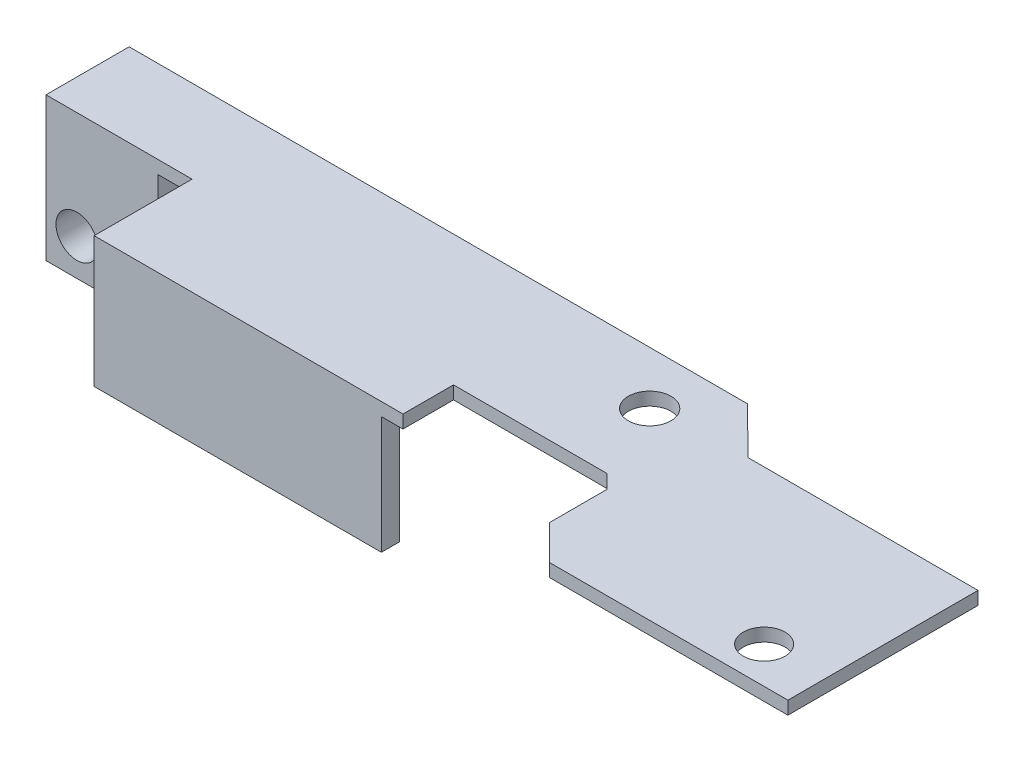
ISO-10303-21;
HEADER;
FILE_DESCRIPTION(('STEP AP214'),'2;1');
FILE_NAME('part.step','',(''),(''),'','','');
FILE_SCHEMA(('AUTOMOTIVE_DESIGN { 1 0 10303 214 1 1 1 1 }'));
ENDSEC;
DATA;
#1=APPLICATION_CONTEXT('core data for automotive mechanical design processes');
#2=APPLICATION_PROTOCOL_DEFINITION('international standard','automotive_design',2000,#1);
#3=PRODUCT_CONTEXT('',#1,'mechanical');
#4=PRODUCT('Part','Part','',(#3));
#5=PRODUCT_RELATED_PRODUCT_CATEGORY('part','',(#4));
#6=PRODUCT_DEFINITION_FORMATION('','',#4);
#7=PRODUCT_DEFINITION_CONTEXT('part definition',#1,'design');
#8=PRODUCT_DEFINITION('design','',#6,#7);
#9=PRODUCT_DEFINITION_SHAPE('','',#8);
#10=(LENGTH_UNIT() NAMED_UNIT(*) SI_UNIT(.MILLI.,.METRE.));
#11=(NAMED_UNIT(*) PLANE_ANGLE_UNIT() SI_UNIT($,.RADIAN.));
#12=(NAMED_UNIT(*) SI_UNIT($,.STERADIAN.) SOLID_ANGLE_UNIT());
#13=UNCERTAINTY_MEASURE_WITH_UNIT(LENGTH_MEASURE(1.E-05),#10,'distance_accuracy_value','');
#14=(GEOMETRIC_REPRESENTATION_CONTEXT(3) GLOBAL_UNCERTAINTY_ASSIGNED_CONTEXT((#13)) GLOBAL_UNIT_ASSIGNED_CONTEXT((#10,
#11,#12)) REPRESENTATION_CONTEXT('',''));
#15=CARTESIAN_POINT('',(0.,0.,0.));
#16=DIRECTION('',(0.,0.,1.));
#17=DIRECTION('',(1.,0.,0.));
#18=AXIS2_PLACEMENT_3D('',#15,#16,#17);
#19=CARTESIAN_POINT('',(0.,0.,0.));
#20=DIRECTION('',(0.,-1.,0.));
#21=DIRECTION('',(0.,0.,-1.));
#22=AXIS2_PLACEMENT_3D('',#19,#20,#21);
#23=PLANE('',#22);
#24=DIRECTION('',(-1.,0.,0.));
#25=VECTOR('',#24,1.);
#26=CARTESIAN_POINT('',(-57.9590886407395,0.,1.36638278632961));
#27=LINE('',#26,#25);
#28=CARTESIAN_POINT('',(-46.7720066556487,0.,1.36638278632961));
#29=VERTEX_POINT('',#28);
#30=CARTESIAN_POINT('',(-49.3972410342507,0.,1.36638278632961));
#31=VERTEX_POINT('',#30);
#32=EDGE_CURVE('E192',#29,#31,#27,.T.);
#33=ORIENTED_EDGE('',*,*,#32,.T.);
#34=DIRECTION('',(0.,0.,1.));
#35=VECTOR('',#34,1.);
#36=CARTESIAN_POINT('',(-49.3972410342507,0.,2.36638278632961));
#37=LINE('',#36,#35);
#38=CARTESIAN_POINT('',(-49.3972410342507,0.,-5.));
#39=VERTEX_POINT('',#38);
#40=EDGE_CURVE('E191',#39,#31,#37,.T.);
#41=ORIENTED_EDGE('',*,*,#40,.F.);
#42=DIRECTION('',(-1.,0.,0.));
#43=VECTOR('',#42,1.);
#44=CARTESIAN_POINT('',(-59.2590886407395,0.,-5.));
#45=LINE('',#44,#43);
#46=CARTESIAN_POINT('',(-10.5928853754941,0.,-5.));
#47=VERTEX_POINT('',#46);
#48=EDGE_CURVE('E274',#47,#39,#45,.T.);
#49=ORIENTED_EDGE('',*,*,#48,.F.);
#50=DIRECTION('',(-0.708293229836923,0.,-0.705918338455079));
#51=VECTOR('',#50,1.);
#52=CARTESIAN_POINT('',(-10.5928853754941,0.,-5.));
#53=LINE('',#52,#51);
#54=CARTESIAN_POINT('',(-7.03322684079496,0.,-1.45227692087246));
#55=VERTEX_POINT('',#54);
#56=EDGE_CURVE('E239',#55,#47,#53,.T.);
#57=ORIENTED_EDGE('',*,*,#56,.F.);
#58=DIRECTION('',(-1.,0.,0.));
#59=VECTOR('',#58,1.);
#60=CARTESIAN_POINT('',(-7.03322684079496,0.,-1.45227692087246));
#61=LINE('',#60,#59);
#62=CARTESIAN_POINT('',(10.5928853754941,0.,-1.45227692087246));
#63=VERTEX_POINT('',#62);
#64=EDGE_CURVE('E246',#63,#55,#61,.T.);
#65=ORIENTED_EDGE('',*,*,#64,.F.);
#66=DIRECTION('',(0.,0.,-1.));
#67=VECTOR('',#66,1.);
#68=CARTESIAN_POINT('',(10.5928853754941,0.,5.));
#69=LINE('',#68,#67);
#70=CARTESIAN_POINT('',(10.5928853754941,0.,13.1052865972663));
#71=VERTEX_POINT('',#70);
#72=EDGE_CURVE('E296',#71,#63,#69,.T.);
#73=ORIENTED_EDGE('',*,*,#72,.F.);
#74=DIRECTION('',(1.,0.,0.));
#75=VECTOR('',#74,1.);
#76=CARTESIAN_POINT('',(10.5928853754941,0.,13.1052865972663));
#77=LINE('',#76,#75);
#78=CARTESIAN_POINT('',(-7.64895836213277,0.,13.1052865972663));
#79=VERTEX_POINT('',#78);
#80=EDGE_CURVE('E293',#79,#71,#77,.T.);
#81=ORIENTED_EDGE('',*,*,#80,.F.);
#82=DIRECTION('',(0.707106781186548,0.,0.707106781186547));
#83=VECTOR('',#82,1.);
#84=CARTESIAN_POINT('',(-7.64895836213277,0.,13.1052865972663));
#85=LINE('',#84,#83);
#86=CARTESIAN_POINT('',(-10.3117462140529,0.,10.4424987453461));
#87=VERTEX_POINT('',#86);
#88=EDGE_CURVE('E291',#87,#79,#85,.T.);
#89=ORIENTED_EDGE('',*,*,#88,.F.);
#90=DIRECTION('',(0.,0.,1.));
#91=VECTOR('',#90,1.);
#92=CARTESIAN_POINT('',(-10.3117462140529,0.,10.4424987453461));
#93=LINE('',#92,#91);
#94=CARTESIAN_POINT('',(-10.3117462140529,0.,6.04969033065439));
#95=VERTEX_POINT('',#94);
#96=EDGE_CURVE('E289',#95,#87,#93,.T.);
#97=ORIENTED_EDGE('',*,*,#96,.F.);
#98=DIRECTION('',(0.707106781186548,0.,0.707106781186548));
#99=VECTOR('',#98,1.);
#100=CARTESIAN_POINT('',(-10.3117462140529,0.,6.04969033065439));
#101=LINE('',#100,#99);
#102=CARTESIAN_POINT('',(-11.3640576509498,0.,4.99737889375753));
#103=VERTEX_POINT('',#102);
#104=EDGE_CURVE('E287',#103,#95,#101,.T.);
#105=ORIENTED_EDGE('',*,*,#104,.F.);
#106=DIRECTION('',(0.012396503632101,0.,-0.999923160396687));
#107=VECTOR('',#106,1.);
#108=CARTESIAN_POINT('',(-11.3640576509498,0.,4.99737889375753));
#109=LINE('',#108,#107);
#110=CARTESIAN_POINT('',(-11.3640901459998,0.,5.));
#111=VERTEX_POINT('',#110);
#112=EDGE_CURVE('E285',#111,#103,#109,.T.);
#113=ORIENTED_EDGE('',*,*,#112,.F.);
#114=DIRECTION('',(1.,0.,0.));
#115=VECTOR('',#114,1.);
#116=CARTESIAN_POINT('',(-23.1200043074193,0.,5.));
#117=LINE('',#116,#115);
#118=CARTESIAN_POINT('',(-23.1200043074193,0.,5.));
#119=VERTEX_POINT('',#118);
#120=EDGE_CURVE('E283',#119,#111,#117,.T.);
#121=ORIENTED_EDGE('',*,*,#120,.F.);
#122=DIRECTION('',(0.,0.,-1.));
#123=VECTOR('',#122,1.);
#124=CARTESIAN_POINT('',(-23.1200043074193,0.,8.86638278632961));
#125=LINE('',#124,#123);
#126=CARTESIAN_POINT('',(-23.1200043074193,0.,8.86638278632961));
#127=VERTEX_POINT('',#126);
#128=EDGE_CURVE('E281',#127,#119,#125,.T.);
#129=ORIENTED_EDGE('',*,*,#128,.F.);
#130=DIRECTION('',(1.,0.,0.));
#131=VECTOR('',#130,1.);
#132=CARTESIAN_POINT('',(-46.7720066556487,0.,8.86638278632961));
#133=LINE('',#132,#131);
#134=CARTESIAN_POINT('',(-24.7755677780219,0.,8.86638278632961));
#135=VERTEX_POINT('',#134);
#136=EDGE_CURVE('E279',#135,#127,#133,.T.);
#137=ORIENTED_EDGE('',*,*,#136,.F.);
#138=DIRECTION('',(0.,0.,1.));
#139=VECTOR('',#138,1.);
#140=CARTESIAN_POINT('',(-24.7755677780219,0.,8.86638278632961));
#141=LINE('',#140,#139);
#142=CARTESIAN_POINT('',(-24.7755677780219,0.,7.46638278632961));
#143=VERTEX_POINT('',#142);
#144=EDGE_CURVE('E210',#143,#135,#141,.T.);
#145=ORIENTED_EDGE('',*,*,#144,.F.);
#146=DIRECTION('',(1.,0.,0.));
#147=VECTOR('',#146,1.);
#148=CARTESIAN_POINT('',(-46.7720066556487,0.,7.46638278632961));
#149=LINE('',#148,#147);
#150=CARTESIAN_POINT('',(-46.7720066556487,0.,7.46638278632961));
#151=VERTEX_POINT('',#150);
#152=EDGE_CURVE('E58',#151,#143,#149,.T.);
#153=ORIENTED_EDGE('',*,*,#152,.F.);
#154=DIRECTION('',(0.,0.,1.));
#155=VECTOR('',#154,1.);
#156=CARTESIAN_POINT('',(-46.7720066556487,0.,2.36638278632961));
#157=LINE('',#156,#155);
#158=EDGE_CURVE('E277',#29,#151,#157,.T.);
#159=ORIENTED_EDGE('',*,*,#158,.F.);
#160=EDGE_LOOP('',(#33,#41,#49,#57,#65,#73,#81,#89,#97,#105,#113,#121,#129,#137,#145,#153,#159));
#161=FACE_BOUND('',#160,.T.);
#162=CARTESIAN_POINT('',(-14.0394003656733,0.,-0.942703980219986));
#163=DIRECTION('',(0.,1.,0.));
#164=DIRECTION('',(0.,0.,1.));
#165=AXIS2_PLACEMENT_3D('',#162,#163,#164);
#166=CIRCLE('',#165,1.63256657868634);
#167=CARTESIAN_POINT('',(-14.0394003656733,0.,0.689862598466358));
#168=VERTEX_POINT('',#167);
#169=EDGE_CURVE('E233',#168,#168,#166,.T.);
#170=ORIENTED_EDGE('',*,*,#169,.T.);
#171=EDGE_LOOP('',(#170));
#172=FACE_BOUND('',#171,.T.);
#173=CARTESIAN_POINT('',(5.9687902256396,0.,10.3003450756937));
#174=DIRECTION('',(0.,1.,0.));
#175=DIRECTION('',(0.,0.,1.));
#176=AXIS2_PLACEMENT_3D('',#173,#174,#175);
#177=CIRCLE('',#176,1.6);
#178=CARTESIAN_POINT('',(5.9687902256396,0.,11.9003450756937));
#179=VERTEX_POINT('',#178);
#180=EDGE_CURVE('E229',#179,#179,#177,.T.);
#181=ORIENTED_EDGE('',*,*,#180,.T.);
#182=EDGE_LOOP('',(#181));
#183=FACE_BOUND('',#182,.T.);
#184=ADVANCED_FACE('F35',(#161,#172,#183),#23,.T.);
#185=CARTESIAN_POINT('',(0.,1.,0.));
#186=DIRECTION('',(0.,-1.,0.));
#187=DIRECTION('',(0.,0.,-1.));
#188=AXIS2_PLACEMENT_3D('',#185,#186,#187);
#189=PLANE('',#188);
#190=DIRECTION('',(-1.,0.,0.));
#191=VECTOR('',#190,1.);
#192=CARTESIAN_POINT('',(-59.2590886407395,1.,-5.));
#193=LINE('',#192,#191);
#194=CARTESIAN_POINT('',(-10.5928853754941,1.,-5.));
#195=VERTEX_POINT('',#194);
#196=CARTESIAN_POINT('',(-57.9590886407395,1.,-5.));
#197=VERTEX_POINT('',#196);
#198=EDGE_CURVE('E245',#195,#197,#193,.T.);
#199=ORIENTED_EDGE('',*,*,#198,.T.);
#200=DIRECTION('',(0.,0.,-1.));
#201=VECTOR('',#200,1.);
#202=CARTESIAN_POINT('',(-57.9590886407395,1.,-5.));
#203=LINE('',#202,#201);
#204=CARTESIAN_POINT('',(-57.9590886407395,1.,1.36638278632961));
#205=VERTEX_POINT('',#204);
#206=EDGE_CURVE('E373',#205,#197,#203,.T.);
#207=ORIENTED_EDGE('',*,*,#206,.F.);
#208=DIRECTION('',(-1.,0.,0.));
#209=VECTOR('',#208,1.);
#210=CARTESIAN_POINT('',(-57.9590886407395,1.,1.36638278632961));
#211=LINE('',#210,#209);
#212=CARTESIAN_POINT('',(-46.7720066556487,1.,1.36638278632961));
#213=VERTEX_POINT('',#212);
#214=EDGE_CURVE('E371',#213,#205,#211,.T.);
#215=ORIENTED_EDGE('',*,*,#214,.F.);
#216=DIRECTION('',(0.,0.,1.));
#217=VECTOR('',#216,1.);
#218=CARTESIAN_POINT('',(-46.7720066556487,1.,2.36638278632961));
#219=LINE('',#218,#217);
#220=CARTESIAN_POINT('',(-46.7720066556487,1.,8.86638278632961));
#221=VERTEX_POINT('',#220);
#222=EDGE_CURVE('E249',#213,#221,#219,.T.);
#223=ORIENTED_EDGE('',*,*,#222,.T.);
#224=DIRECTION('',(1.,0.,0.));
#225=VECTOR('',#224,1.);
#226=CARTESIAN_POINT('',(-46.7720066556487,1.,8.86638278632961));
#227=LINE('',#226,#225);
#228=CARTESIAN_POINT('',(-23.1200043074193,1.,8.86638278632961));
#229=VERTEX_POINT('',#228);
#230=EDGE_CURVE('E251',#221,#229,#227,.T.);
#231=ORIENTED_EDGE('',*,*,#230,.T.);
#232=DIRECTION('',(0.,0.,-1.));
#233=VECTOR('',#232,1.);
#234=CARTESIAN_POINT('',(-23.1200043074193,1.,8.86638278632961));
#235=LINE('',#234,#233);
#236=CARTESIAN_POINT('',(-23.1200043074193,1.,5.));
#237=VERTEX_POINT('',#236);
#238=EDGE_CURVE('E253',#229,#237,#235,.T.);
#239=ORIENTED_EDGE('',*,*,#238,.T.);
#240=DIRECTION('',(1.,0.,0.));
#241=VECTOR('',#240,1.);
#242=CARTESIAN_POINT('',(-23.1200043074193,1.,5.));
#243=LINE('',#242,#241);
#244=CARTESIAN_POINT('',(-11.3640901459998,1.,5.));
#245=VERTEX_POINT('',#244);
#246=EDGE_CURVE('E255',#237,#245,#243,.T.);
#247=ORIENTED_EDGE('',*,*,#246,.T.);
#248=DIRECTION('',(0.012396503632101,0.,-0.999923160396687));
#249=VECTOR('',#248,1.);
#250=CARTESIAN_POINT('',(-11.3640576509498,1.,4.99737889375753));
#251=LINE('',#250,#249);
#252=CARTESIAN_POINT('',(-11.3640576509498,1.,4.99737889375753));
#253=VERTEX_POINT('',#252);
#254=EDGE_CURVE('E257',#245,#253,#251,.T.);
#255=ORIENTED_EDGE('',*,*,#254,.T.);
#256=DIRECTION('',(0.707106781186548,0.,0.707106781186548));
#257=VECTOR('',#256,1.);
#258=CARTESIAN_POINT('',(-10.3117462140529,1.,6.04969033065439));
#259=LINE('',#258,#257);
#260=CARTESIAN_POINT('',(-10.3117462140529,1.,6.04969033065439));
#261=VERTEX_POINT('',#260);
#262=EDGE_CURVE('E259',#253,#261,#259,.T.);
#263=ORIENTED_EDGE('',*,*,#262,.T.);
#264=DIRECTION('',(0.,0.,1.));
#265=VECTOR('',#264,1.);
#266=CARTESIAN_POINT('',(-10.3117462140529,1.,10.4424987453461));
#267=LINE('',#266,#265);
#268=CARTESIAN_POINT('',(-10.3117462140529,1.,10.4424987453461));
#269=VERTEX_POINT('',#268);
#270=EDGE_CURVE('E261',#261,#269,#267,.T.);
#271=ORIENTED_EDGE('',*,*,#270,.T.);
#272=DIRECTION('',(0.707106781186548,0.,0.707106781186547));
#273=VECTOR('',#272,1.);
#274=CARTESIAN_POINT('',(-7.64895836213277,1.,13.1052865972663));
#275=LINE('',#274,#273);
#276=CARTESIAN_POINT('',(-7.64895836213277,1.,13.1052865972663));
#277=VERTEX_POINT('',#276);
#278=EDGE_CURVE('E263',#269,#277,#275,.T.);
#279=ORIENTED_EDGE('',*,*,#278,.T.);
#280=DIRECTION('',(1.,0.,0.));
#281=VECTOR('',#280,1.);
#282=CARTESIAN_POINT('',(10.5928853754941,1.,13.1052865972663));
#283=LINE('',#282,#281);
#284=CARTESIAN_POINT('',(10.5928853754941,1.,13.1052865972663));
#285=VERTEX_POINT('',#284);
#286=EDGE_CURVE('E265',#277,#285,#283,.T.);
#287=ORIENTED_EDGE('',*,*,#286,.T.);
#288=DIRECTION('',(0.,0.,-1.));
#289=VECTOR('',#288,1.);
#290=CARTESIAN_POINT('',(10.5928853754941,1.,5.));
#291=LINE('',#290,#289);
#292=CARTESIAN_POINT('',(10.5928853754941,1.,-1.45227692087246));
#293=VERTEX_POINT('',#292);
#294=EDGE_CURVE('E267',#285,#293,#291,.T.);
#295=ORIENTED_EDGE('',*,*,#294,.T.);
#296=DIRECTION('',(-1.,0.,0.));
#297=VECTOR('',#296,1.);
#298=CARTESIAN_POINT('',(-7.03322684079496,1.,-1.45227692087246));
#299=LINE('',#298,#297);
#300=CARTESIAN_POINT('',(-7.03322684079496,1.,-1.45227692087246));
#301=VERTEX_POINT('',#300);
#302=EDGE_CURVE('E269',#293,#301,#299,.T.);
#303=ORIENTED_EDGE('',*,*,#302,.T.);
#304=DIRECTION('',(-0.708293229836923,0.,-0.705918338455079));
#305=VECTOR('',#304,1.);
#306=CARTESIAN_POINT('',(-10.5928853754941,1.,-5.));
#307=LINE('',#306,#305);
#308=EDGE_CURVE('E242',#301,#195,#307,.T.);
#309=ORIENTED_EDGE('',*,*,#308,.T.);
#310=EDGE_LOOP('',(#199,#207,#215,#223,#231,#239,#247,#255,#263,#271,#279,#287,#295,#303,#309));
#311=FACE_BOUND('',#310,.T.);
#312=CARTESIAN_POINT('',(-14.0394003656733,1.,-0.942703980219986));
#313=DIRECTION('',(0.,1.,0.));
#314=DIRECTION('',(0.,0.,1.));
#315=AXIS2_PLACEMENT_3D('',#312,#313,#314);
#316=CIRCLE('',#315,1.63256657868634);
#317=CARTESIAN_POINT('',(-14.0394003656733,1.,0.689862598466358));
#318=VERTEX_POINT('',#317);
#319=EDGE_CURVE('E236',#318,#318,#316,.T.);
#320=ORIENTED_EDGE('',*,*,#319,.F.);
#321=EDGE_LOOP('',(#320));
#322=FACE_BOUND('',#321,.T.);
#323=CARTESIAN_POINT('',(5.9687902256396,1.,10.3003450756937));
#324=DIRECTION('',(0.,1.,0.));
#325=DIRECTION('',(0.,0.,1.));
#326=AXIS2_PLACEMENT_3D('',#323,#324,#325);
#327=CIRCLE('',#326,1.6);
#328=CARTESIAN_POINT('',(5.9687902256396,1.,11.9003450756937));
#329=VERTEX_POINT('',#328);
#330=EDGE_CURVE('E230',#329,#329,#327,.T.);
#331=ORIENTED_EDGE('',*,*,#330,.F.);
#332=EDGE_LOOP('',(#331));
#333=FACE_BOUND('',#332,.T.);
#334=ADVANCED_FACE('F366',(#311,#322,#333),#189,.F.);
#335=CARTESIAN_POINT('',(-10.5928853754941,1.,-5.));
#336=DIRECTION('',(-0.705918338455079,0.,0.708293229836923));
#337=DIRECTION('',(0.708293229836923,0.,0.705918338455079));
#338=AXIS2_PLACEMENT_3D('',#335,#336,#337);
#339=PLANE('',#338);
#340=ORIENTED_EDGE('',*,*,#56,.T.);
#341=DIRECTION('',(0.,-1.,0.));
#342=VECTOR('',#341,1.);
#343=CARTESIAN_POINT('',(-10.5928853754941,1.,-5.));
#344=LINE('',#343,#342);
#345=EDGE_CURVE('E11',#195,#47,#344,.T.);
#346=ORIENTED_EDGE('',*,*,#345,.F.);
#347=ORIENTED_EDGE('',*,*,#308,.F.);
#348=DIRECTION('',(0.,-1.,0.));
#349=VECTOR('',#348,1.);
#350=CARTESIAN_POINT('',(-7.03322684079496,1.,-1.45227692087246));
#351=LINE('',#350,#349);
#352=EDGE_CURVE('E271',#301,#55,#351,.T.);
#353=ORIENTED_EDGE('',*,*,#352,.T.);
#354=EDGE_LOOP('',(#340,#346,#347,#353));
#355=FACE_BOUND('',#354,.T.);
#356=ADVANCED_FACE('F37',(#355),#339,.F.);
#357=CARTESIAN_POINT('',(-59.2590886407395,1.,-5.));
#358=DIRECTION('',(0.,0.,1.));
#359=DIRECTION('',(1.,0.,0.));
#360=AXIS2_PLACEMENT_3D('',#357,#358,#359);
#361=PLANE('',#360);
#362=CARTESIAN_POINT('',(-55.5948832851514,-7.20000000000001,-5.));
#363=DIRECTION('',(0.,0.,1.));
#364=DIRECTION('',(1.,0.,0.));
#365=AXIS2_PLACEMENT_3D('',#362,#363,#364);
#366=CIRCLE('',#365,1.6);
#367=CARTESIAN_POINT('',(-53.9948832851514,-7.20000000000001,-5.));
#368=VERTEX_POINT('',#367);
#369=EDGE_CURVE('E204',#368,#368,#366,.F.);
#370=ORIENTED_EDGE('',*,*,#369,.F.);
#371=EDGE_LOOP('',(#370));
#372=FACE_BOUND('',#371,.T.);
#373=DIRECTION('',(1.,0.,0.));
#374=VECTOR('',#373,1.);
#375=CARTESIAN_POINT('',(-59.2590886407395,-10.,-5.));
#376=LINE('',#375,#374);
#377=CARTESIAN_POINT('',(-57.9590886407395,-10.,-5.));
#378=VERTEX_POINT('',#377);
#379=CARTESIAN_POINT('',(-49.3972410342507,-10.,-5.));
#380=VERTEX_POINT('',#379);
#381=EDGE_CURVE('E196',#378,#380,#376,.T.);
#382=ORIENTED_EDGE('',*,*,#381,.F.);
#383=DIRECTION('',(0.,1.,0.));
#384=VECTOR('',#383,1.);
#385=CARTESIAN_POINT('',(-57.9590886407395,-10.001,-5.));
#386=LINE('',#385,#384);
#387=EDGE_CURVE('E50',#378,#197,#386,.T.);
#388=ORIENTED_EDGE('',*,*,#387,.T.);
#389=ORIENTED_EDGE('',*,*,#198,.F.);
#390=ORIENTED_EDGE('',*,*,#345,.T.);
#391=ORIENTED_EDGE('',*,*,#48,.T.);
#392=DIRECTION('',(0.,1.,0.));
#393=VECTOR('',#392,1.);
#394=CARTESIAN_POINT('',(-49.3972410342507,-10.,-5.));
#395=LINE('',#394,#393);
#396=EDGE_CURVE('E198',#380,#39,#395,.T.);
#397=ORIENTED_EDGE('',*,*,#396,.F.);
#398=EDGE_LOOP('',(#382,#388,#389,#390,#391,#397));
#399=FACE_BOUND('',#398,.T.);
#400=ADVANCED_FACE('F391',(#372,#399),#361,.F.);
#401=CARTESIAN_POINT('',(-46.7720066556487,1.,2.36638278632961));
#402=DIRECTION('',(1.,0.,0.));
#403=DIRECTION('',(0.,0.,-1.));
#404=AXIS2_PLACEMENT_3D('',#401,#402,#403);
#405=PLANE('',#404);
#406=ORIENTED_EDGE('',*,*,#158,.T.);
#407=DIRECTION('',(0.,1.,0.));
#408=VECTOR('',#407,1.);
#409=CARTESIAN_POINT('',(-46.7720066556487,-9.,7.46638278632961));
#410=LINE('',#409,#408);
#411=CARTESIAN_POINT('',(-46.7720066556487,-9.,7.46638278632961));
#412=VERTEX_POINT('',#411);
#413=EDGE_CURVE('E226',#412,#151,#410,.T.);
#414=ORIENTED_EDGE('',*,*,#413,.F.);
#415=DIRECTION('',(0.,0.,-1.));
#416=VECTOR('',#415,1.);
#417=CARTESIAN_POINT('',(-46.7720066556487,-9.,8.86638278632961));
#418=LINE('',#417,#416);
#419=CARTESIAN_POINT('',(-46.7720066556487,-9.,8.86638278632961));
#420=VERTEX_POINT('',#419);
#421=EDGE_CURVE('E206',#420,#412,#418,.T.);
#422=ORIENTED_EDGE('',*,*,#421,.F.);
#423=DIRECTION('',(0.,-1.,0.));
#424=VECTOR('',#423,1.);
#425=CARTESIAN_POINT('',(-46.7720066556487,1.,8.86638278632961));
#426=LINE('',#425,#424);
#427=EDGE_CURVE('E43',#221,#420,#426,.T.);
#428=ORIENTED_EDGE('',*,*,#427,.F.);
#429=ORIENTED_EDGE('',*,*,#222,.F.);
#430=DIRECTION('',(0.,1.,0.));
#431=VECTOR('',#430,1.);
#432=CARTESIAN_POINT('',(-46.7720066556487,-10.001,1.36638278632961));
#433=LINE('',#432,#431);
#434=EDGE_CURVE('E372',#29,#213,#433,.T.);
#435=ORIENTED_EDGE('',*,*,#434,.F.);
#436=EDGE_LOOP('',(#406,#414,#422,#428,#429,#435));
#437=FACE_BOUND('',#436,.T.);
#438=ADVANCED_FACE('F340',(#437),#405,.F.);
#439=CARTESIAN_POINT('',(-46.7720066556487,1.,8.86638278632961));
#440=DIRECTION('',(0.,0.,-1.));
#441=DIRECTION('',(-1.,0.,0.));
#442=AXIS2_PLACEMENT_3D('',#439,#440,#441);
#443=PLANE('',#442);
#444=ORIENTED_EDGE('',*,*,#427,.T.);
#445=DIRECTION('',(-1.,0.,0.));
#446=VECTOR('',#445,1.);
#447=CARTESIAN_POINT('',(-46.7720066556487,-9.,8.86638278632961));
#448=LINE('',#447,#446);
#449=CARTESIAN_POINT('',(-24.7755677780219,-9.,8.86638278632961));
#450=VERTEX_POINT('',#449);
#451=EDGE_CURVE('E214',#450,#420,#448,.T.);
#452=ORIENTED_EDGE('',*,*,#451,.F.);
#453=DIRECTION('',(0.,1.,0.));
#454=VECTOR('',#453,1.);
#455=CARTESIAN_POINT('',(-24.7755677780219,-9.,8.86638278632961));
#456=LINE('',#455,#454);
#457=EDGE_CURVE('E217',#450,#135,#456,.T.);
#458=ORIENTED_EDGE('',*,*,#457,.T.);
#459=ORIENTED_EDGE('',*,*,#136,.T.);
#460=DIRECTION('',(0.,-1.,0.));
#461=VECTOR('',#460,1.);
#462=CARTESIAN_POINT('',(-23.1200043074193,1.,8.86638278632961));
#463=LINE('',#462,#461);
#464=EDGE_CURVE('E325',#229,#127,#463,.T.);
#465=ORIENTED_EDGE('',*,*,#464,.F.);
#466=ORIENTED_EDGE('',*,*,#230,.F.);
#467=EDGE_LOOP('',(#444,#452,#458,#459,#465,#466));
#468=FACE_BOUND('',#467,.T.);
#469=ADVANCED_FACE('F331',(#468),#443,.F.);
#470=CARTESIAN_POINT('',(-23.1200043074193,1.,8.86638278632961));
#471=DIRECTION('',(-1.,0.,0.));
#472=DIRECTION('',(0.,0.,1.));
#473=AXIS2_PLACEMENT_3D('',#470,#471,#472);
#474=PLANE('',#473);
#475=ORIENTED_EDGE('',*,*,#128,.T.);
#476=DIRECTION('',(0.,-1.,0.));
#477=VECTOR('',#476,1.);
#478=CARTESIAN_POINT('',(-23.1200043074193,1.,5.));
#479=LINE('',#478,#477);
#480=EDGE_CURVE('E322',#237,#119,#479,.T.);
#481=ORIENTED_EDGE('',*,*,#480,.F.);
#482=ORIENTED_EDGE('',*,*,#238,.F.);
#483=ORIENTED_EDGE('',*,*,#464,.T.);
#484=EDGE_LOOP('',(#475,#481,#482,#483));
#485=FACE_BOUND('',#484,.T.);
#486=ADVANCED_FACE('F350',(#485),#474,.F.);
#487=CARTESIAN_POINT('',(-23.1200043074193,1.,5.));
#488=DIRECTION('',(0.,0.,-1.));
#489=DIRECTION('',(-1.,0.,0.));
#490=AXIS2_PLACEMENT_3D('',#487,#488,#489);
#491=PLANE('',#490);
#492=ORIENTED_EDGE('',*,*,#120,.T.);
#493=DIRECTION('',(0.,-1.,0.));
#494=VECTOR('',#493,1.);
#495=CARTESIAN_POINT('',(-11.3640901459998,1.,5.));
#496=LINE('',#495,#494);
#497=EDGE_CURVE('E319',#245,#111,#496,.T.);
#498=ORIENTED_EDGE('',*,*,#497,.F.);
#499=ORIENTED_EDGE('',*,*,#246,.F.);
#500=ORIENTED_EDGE('',*,*,#480,.T.);
#501=EDGE_LOOP('',(#492,#498,#499,#500));
#502=FACE_BOUND('',#501,.T.);
#503=ADVANCED_FACE('F358',(#502),#491,.F.);
#504=CARTESIAN_POINT('',(-11.3640576509498,1.,4.99737889375753));
#505=DIRECTION('',(-0.999923160396687,0.,-0.012396503632101));
#506=DIRECTION('',(-0.012396503632101,0.,0.999923160396687));
#507=AXIS2_PLACEMENT_3D('',#504,#505,#506);
#508=PLANE('',#507);
#509=ORIENTED_EDGE('',*,*,#112,.T.);
#510=DIRECTION('',(0.,-1.,0.));
#511=VECTOR('',#510,1.);
#512=CARTESIAN_POINT('',(-11.3640576509498,1.,4.99737889375753));
#513=LINE('',#512,#511);
#514=EDGE_CURVE('E316',#253,#103,#513,.T.);
#515=ORIENTED_EDGE('',*,*,#514,.F.);
#516=ORIENTED_EDGE('',*,*,#254,.F.);
#517=ORIENTED_EDGE('',*,*,#497,.T.);
#518=EDGE_LOOP('',(#509,#515,#516,#517));
#519=FACE_BOUND('',#518,.T.);
#520=ADVANCED_FACE('F362',(#519),#508,.F.);
#521=CARTESIAN_POINT('',(-10.3117462140529,1.,6.04969033065439));
#522=DIRECTION('',(0.707106781186547,0.,-0.707106781186547));
#523=DIRECTION('',(-0.707106781186548,0.,-0.707106781186548));
#524=AXIS2_PLACEMENT_3D('',#521,#522,#523);
#525=PLANE('',#524);
#526=ORIENTED_EDGE('',*,*,#104,.T.);
#527=DIRECTION('',(0.,-1.,0.));
#528=VECTOR('',#527,1.);
#529=CARTESIAN_POINT('',(-10.3117462140529,1.,6.04969033065439));
#530=LINE('',#529,#528);
#531=EDGE_CURVE('E313',#261,#95,#530,.T.);
#532=ORIENTED_EDGE('',*,*,#531,.F.);
#533=ORIENTED_EDGE('',*,*,#262,.F.);
#534=ORIENTED_EDGE('',*,*,#514,.T.);
#535=EDGE_LOOP('',(#526,#532,#533,#534));
#536=FACE_BOUND('',#535,.T.);
#537=ADVANCED_FACE('F420',(#536),#525,.F.);
#538=CARTESIAN_POINT('',(-10.3117462140529,1.,10.4424987453461));
#539=DIRECTION('',(1.,0.,0.));
#540=DIRECTION('',(0.,0.,-1.));
#541=AXIS2_PLACEMENT_3D('',#538,#539,#540);
#542=PLANE('',#541);
#543=ORIENTED_EDGE('',*,*,#96,.T.);
#544=DIRECTION('',(0.,-1.,0.));
#545=VECTOR('',#544,1.);
#546=CARTESIAN_POINT('',(-10.3117462140529,1.,10.4424987453461));
#547=LINE('',#546,#545);
#548=EDGE_CURVE('E310',#269,#87,#547,.T.);
#549=ORIENTED_EDGE('',*,*,#548,.F.);
#550=ORIENTED_EDGE('',*,*,#270,.F.);
#551=ORIENTED_EDGE('',*,*,#531,.T.);
#552=EDGE_LOOP('',(#543,#549,#550,#551));
#553=FACE_BOUND('',#552,.T.);
#554=ADVANCED_FACE('F418',(#553),#542,.F.);
#555=CARTESIAN_POINT('',(-7.64895836213277,1.,13.1052865972663));
#556=DIRECTION('',(0.707106781186547,0.,-0.707106781186548));
#557=DIRECTION('',(-0.707106781186548,0.,-0.707106781186547));
#558=AXIS2_PLACEMENT_3D('',#555,#556,#557);
#559=PLANE('',#558);
#560=ORIENTED_EDGE('',*,*,#88,.T.);
#561=DIRECTION('',(0.,-1.,0.));
#562=VECTOR('',#561,1.);
#563=CARTESIAN_POINT('',(-7.64895836213277,1.,13.1052865972663));
#564=LINE('',#563,#562);
#565=EDGE_CURVE('E307',#277,#79,#564,.T.);
#566=ORIENTED_EDGE('',*,*,#565,.F.);
#567=ORIENTED_EDGE('',*,*,#278,.F.);
#568=ORIENTED_EDGE('',*,*,#548,.T.);
#569=EDGE_LOOP('',(#560,#566,#567,#568));
#570=FACE_BOUND('',#569,.T.);
#571=ADVANCED_FACE('F413',(#570),#559,.F.);
#572=CARTESIAN_POINT('',(10.5928853754941,1.,13.1052865972663));
#573=DIRECTION('',(0.,0.,-1.));
#574=DIRECTION('',(-1.,0.,0.));
#575=AXIS2_PLACEMENT_3D('',#572,#573,#574);
#576=PLANE('',#575);
#577=ORIENTED_EDGE('',*,*,#80,.T.);
#578=DIRECTION('',(0.,-1.,0.));
#579=VECTOR('',#578,1.);
#580=CARTESIAN_POINT('',(10.5928853754941,1.,13.1052865972663));
#581=LINE('',#580,#579);
#582=EDGE_CURVE('E304',#285,#71,#581,.T.);
#583=ORIENTED_EDGE('',*,*,#582,.F.);
#584=ORIENTED_EDGE('',*,*,#286,.F.);
#585=ORIENTED_EDGE('',*,*,#565,.T.);
#586=EDGE_LOOP('',(#577,#583,#584,#585));
#587=FACE_BOUND('',#586,.T.);
#588=ADVANCED_FACE('F408',(#587),#576,.F.);
#589=CARTESIAN_POINT('',(10.5928853754941,1.,5.));
#590=DIRECTION('',(-1.,0.,0.));
#591=DIRECTION('',(0.,0.,1.));
#592=AXIS2_PLACEMENT_3D('',#589,#590,#591);
#593=PLANE('',#592);
#594=ORIENTED_EDGE('',*,*,#72,.T.);
#595=DIRECTION('',(0.,-1.,0.));
#596=VECTOR('',#595,1.);
#597=CARTESIAN_POINT('',(10.5928853754941,1.,-1.45227692087246));
#598=LINE('',#597,#596);
#599=EDGE_CURVE('E301',#293,#63,#598,.T.);
#600=ORIENTED_EDGE('',*,*,#599,.F.);
#601=ORIENTED_EDGE('',*,*,#294,.F.);
#602=ORIENTED_EDGE('',*,*,#582,.T.);
#603=EDGE_LOOP('',(#594,#600,#601,#602));
#604=FACE_BOUND('',#603,.T.);
#605=ADVANCED_FACE('F404',(#604),#593,.F.);
#606=CARTESIAN_POINT('',(-7.03322684079496,1.,-1.45227692087246));
#607=DIRECTION('',(0.,0.,1.));
#608=DIRECTION('',(1.,0.,0.));
#609=AXIS2_PLACEMENT_3D('',#606,#607,#608);
#610=PLANE('',#609);
#611=ORIENTED_EDGE('',*,*,#64,.T.);
#612=ORIENTED_EDGE('',*,*,#352,.F.);
#613=ORIENTED_EDGE('',*,*,#302,.F.);
#614=ORIENTED_EDGE('',*,*,#599,.T.);
#615=EDGE_LOOP('',(#611,#612,#613,#614));
#616=FACE_BOUND('',#615,.T.);
#617=ADVANCED_FACE('F399',(#616),#610,.F.);
#618=CARTESIAN_POINT('',(-14.0394003656733,1.,-0.942703980219986));
#619=DIRECTION('',(0.,-1.,0.));
#620=DIRECTION('',(0.,0.,-1.));
#621=AXIS2_PLACEMENT_3D('',#618,#619,#620);
#622=CYLINDRICAL_SURFACE('',#621,1.63256657868634);
#623=ORIENTED_EDGE('',*,*,#319,.T.);
#624=EDGE_LOOP('',(#623));
#625=FACE_BOUND('',#624,.T.);
#626=ORIENTED_EDGE('',*,*,#169,.F.);
#627=EDGE_LOOP('',(#626));
#628=FACE_BOUND('',#627,.T.);
#629=ADVANCED_FACE('F439',(#625,#628),#622,.F.);
#630=CARTESIAN_POINT('',(5.9687902256396,1.,10.3003450756937));
#631=DIRECTION('',(0.,-1.,0.));
#632=DIRECTION('',(0.,0.,-1.));
#633=AXIS2_PLACEMENT_3D('',#630,#631,#632);
#634=CYLINDRICAL_SURFACE('',#633,1.6);
#635=ORIENTED_EDGE('',*,*,#330,.T.);
#636=EDGE_LOOP('',(#635));
#637=FACE_BOUND('',#636,.T.);
#638=ORIENTED_EDGE('',*,*,#180,.F.);
#639=EDGE_LOOP('',(#638));
#640=FACE_BOUND('',#639,.T.);
#641=ADVANCED_FACE('F467',(#637,#640),#634,.F.);
#642=CARTESIAN_POINT('',(-46.7720066556487,-9.,7.46638278632961));
#643=DIRECTION('',(0.,0.,1.));
#644=DIRECTION('',(1.,0.,0.));
#645=AXIS2_PLACEMENT_3D('',#642,#643,#644);
#646=PLANE('',#645);
#647=ORIENTED_EDGE('',*,*,#152,.T.);
#648=DIRECTION('',(0.,1.,0.));
#649=VECTOR('',#648,1.);
#650=CARTESIAN_POINT('',(-24.7755677780219,-9.,7.46638278632961));
#651=LINE('',#650,#649);
#652=CARTESIAN_POINT('',(-24.7755677780219,-9.,7.46638278632961));
#653=VERTEX_POINT('',#652);
#654=EDGE_CURVE('E223',#653,#143,#651,.T.);
#655=ORIENTED_EDGE('',*,*,#654,.F.);
#656=DIRECTION('',(1.,0.,0.));
#657=VECTOR('',#656,1.);
#658=CARTESIAN_POINT('',(-46.7720066556487,-9.,7.46638278632961));
#659=LINE('',#658,#657);
#660=EDGE_CURVE('E209',#412,#653,#659,.T.);
#661=ORIENTED_EDGE('',*,*,#660,.F.);
#662=ORIENTED_EDGE('',*,*,#413,.T.);
#663=EDGE_LOOP('',(#647,#655,#661,#662));
#664=FACE_BOUND('',#663,.T.);
#665=ADVANCED_FACE('F343',(#664),#646,.F.);
#666=CARTESIAN_POINT('',(-24.7755677780219,-9.,8.86638278632961));
#667=DIRECTION('',(-1.,0.,0.));
#668=DIRECTION('',(0.,0.,1.));
#669=AXIS2_PLACEMENT_3D('',#666,#667,#668);
#670=PLANE('',#669);
#671=ORIENTED_EDGE('',*,*,#144,.T.);
#672=ORIENTED_EDGE('',*,*,#457,.F.);
#673=DIRECTION('',(0.,0.,1.));
#674=VECTOR('',#673,1.);
#675=CARTESIAN_POINT('',(-24.7755677780219,-9.,8.86638278632961));
#676=LINE('',#675,#674);
#677=EDGE_CURVE('E212',#653,#450,#676,.T.);
#678=ORIENTED_EDGE('',*,*,#677,.F.);
#679=ORIENTED_EDGE('',*,*,#654,.T.);
#680=EDGE_LOOP('',(#671,#672,#678,#679));
#681=FACE_BOUND('',#680,.T.);
#682=ADVANCED_FACE('F346',(#681),#670,.F.);
#683=CARTESIAN_POINT('',(0.,-9.,0.));
#684=DIRECTION('',(0.,-1.,0.));
#685=DIRECTION('',(0.,0.,-1.));
#686=AXIS2_PLACEMENT_3D('',#683,#684,#685);
#687=PLANE('',#686);
#688=ORIENTED_EDGE('',*,*,#421,.T.);
#689=ORIENTED_EDGE('',*,*,#660,.T.);
#690=ORIENTED_EDGE('',*,*,#677,.T.);
#691=ORIENTED_EDGE('',*,*,#451,.T.);
#692=EDGE_LOOP('',(#688,#689,#690,#691));
#693=FACE_BOUND('',#692,.T.);
#694=ADVANCED_FACE('F336',(#693),#687,.T.);
#695=CARTESIAN_POINT('',(-49.3972410342507,-10.,2.36638278632961));
#696=DIRECTION('',(-1.,0.,0.));
#697=DIRECTION('',(0.,0.,1.));
#698=AXIS2_PLACEMENT_3D('',#695,#696,#697);
#699=PLANE('',#698);
#700=ORIENTED_EDGE('',*,*,#40,.T.);
#701=DIRECTION('',(0.,1.,0.));
#702=VECTOR('',#701,1.);
#703=CARTESIAN_POINT('',(-49.3972410342507,-10.001,1.36638278632961));
#704=LINE('',#703,#702);
#705=CARTESIAN_POINT('',(-49.3972410342507,-10.,1.36638278632961));
#706=VERTEX_POINT('',#705);
#707=EDGE_CURVE('E177',#706,#31,#704,.T.);
#708=ORIENTED_EDGE('',*,*,#707,.F.);
#709=DIRECTION('',(0.,0.,1.));
#710=VECTOR('',#709,1.);
#711=CARTESIAN_POINT('',(-49.3972410342507,-10.,2.36638278632961));
#712=LINE('',#711,#710);
#713=EDGE_CURVE('E189',#380,#706,#712,.T.);
#714=ORIENTED_EDGE('',*,*,#713,.F.);
#715=ORIENTED_EDGE('',*,*,#396,.T.);
#716=EDGE_LOOP('',(#700,#708,#714,#715));
#717=FACE_BOUND('',#716,.T.);
#718=ADVANCED_FACE('F188',(#717),#699,.F.);
#719=CARTESIAN_POINT('',(0.,-10.,0.));
#720=DIRECTION('',(0.,-1.,0.));
#721=DIRECTION('',(0.,0.,-1.));
#722=AXIS2_PLACEMENT_3D('',#719,#720,#721);
#723=PLANE('',#722);
#724=DIRECTION('',(-1.,0.,0.));
#725=VECTOR('',#724,1.);
#726=CARTESIAN_POINT('',(-57.9590886407395,-10.,1.36638278632961));
#727=LINE('',#726,#725);
#728=CARTESIAN_POINT('',(-57.9590886407395,-10.,1.36638278632961));
#729=VERTEX_POINT('',#728);
#730=EDGE_CURVE('E172',#706,#729,#727,.T.);
#731=ORIENTED_EDGE('',*,*,#730,.T.);
#732=DIRECTION('',(0.,0.,-1.));
#733=VECTOR('',#732,1.);
#734=CARTESIAN_POINT('',(-57.9590886407395,-10.,-5.));
#735=LINE('',#734,#733);
#736=EDGE_CURVE('E183',#729,#378,#735,.T.);
#737=ORIENTED_EDGE('',*,*,#736,.T.);
#738=ORIENTED_EDGE('',*,*,#381,.T.);
#739=ORIENTED_EDGE('',*,*,#713,.T.);
#740=EDGE_LOOP('',(#731,#737,#738,#739));
#741=FACE_BOUND('',#740,.T.);
#742=ADVANCED_FACE('F194',(#741),#723,.T.);
#743=CARTESIAN_POINT('',(-55.5948832851514,-7.20000000000001,-5.001));
#744=DIRECTION('',(0.,0.,1.));
#745=DIRECTION('',(1.,0.,0.));
#746=AXIS2_PLACEMENT_3D('',#743,#744,#745);
#747=CYLINDRICAL_SURFACE('',#746,1.6);
#748=CARTESIAN_POINT('',(-55.5948832851514,-7.20000000000001,1.36638278632961));
#749=DIRECTION('',(0.,0.,-1.));
#750=DIRECTION('',(-1.,0.,0.));
#751=AXIS2_PLACEMENT_3D('',#748,#749,#750);
#752=CIRCLE('',#751,1.6);
#753=CARTESIAN_POINT('',(-57.1948832851513,-7.20000000000001,1.36638278632961));
#754=VERTEX_POINT('',#753);
#755=EDGE_CURVE('E379',#754,#754,#752,.T.);
#756=ORIENTED_EDGE('',*,*,#755,.F.);
#757=EDGE_LOOP('',(#756));
#758=FACE_BOUND('',#757,.T.);
#759=ORIENTED_EDGE('',*,*,#369,.T.);
#760=EDGE_LOOP('',(#759));
#761=FACE_BOUND('',#760,.T.);
#762=ADVANCED_FACE('F507',(#758,#761),#747,.F.);
#763=CARTESIAN_POINT('',(-57.9590886407395,-10.001,1.36638278632961));
#764=DIRECTION('',(0.,0.,-1.));
#765=DIRECTION('',(-1.,0.,0.));
#766=AXIS2_PLACEMENT_3D('',#763,#764,#765);
#767=PLANE('',#766);
#768=ORIENTED_EDGE('',*,*,#755,.T.);
#769=EDGE_LOOP('',(#768));
#770=FACE_BOUND('',#769,.T.);
#771=ORIENTED_EDGE('',*,*,#434,.T.);
#772=ORIENTED_EDGE('',*,*,#214,.T.);
#773=DIRECTION('',(0.,1.,0.));
#774=VECTOR('',#773,1.);
#775=CARTESIAN_POINT('',(-57.9590886407395,-10.001,1.36638278632961));
#776=LINE('',#775,#774);
#777=EDGE_CURVE('E180',#729,#205,#776,.T.);
#778=ORIENTED_EDGE('',*,*,#777,.F.);
#779=ORIENTED_EDGE('',*,*,#730,.F.);
#780=ORIENTED_EDGE('',*,*,#707,.T.);
#781=ORIENTED_EDGE('',*,*,#32,.F.);
#782=EDGE_LOOP('',(#771,#772,#778,#779,#780,#781));
#783=FACE_BOUND('',#782,.T.);
#784=ADVANCED_FACE('F175',(#770,#783),#767,.F.);
#785=CARTESIAN_POINT('',(-57.9590886407395,-10.001,-5.));
#786=DIRECTION('',(1.,0.,0.));
#787=DIRECTION('',(0.,0.,-1.));
#788=AXIS2_PLACEMENT_3D('',#785,#786,#787);
#789=PLANE('',#788);
#790=ORIENTED_EDGE('',*,*,#777,.T.);
#791=ORIENTED_EDGE('',*,*,#206,.T.);
#792=ORIENTED_EDGE('',*,*,#387,.F.);
#793=ORIENTED_EDGE('',*,*,#736,.F.);
#794=EDGE_LOOP('',(#790,#791,#792,#793));
#795=FACE_BOUND('',#794,.T.);
#796=ADVANCED_FACE('F521',(#795),#789,.F.);
#797=CLOSED_SHELL('',(#184,#334,#356,#400,#438,#469,#486,#503,#520,#537,#554,#571,#588,#605,
#617,#629,#641,#665,#682,#694,#718,#742,#762,#784,#796));
#798=MANIFOLD_SOLID_BREP('B2',#797);
#799=ADVANCED_BREP_SHAPE_REPRESENTATION('',(#18,#798),#14);
#800=SHAPE_DEFINITION_REPRESENTATION(#9,#799);
ENDSEC;
END-ISO-10303-21;
